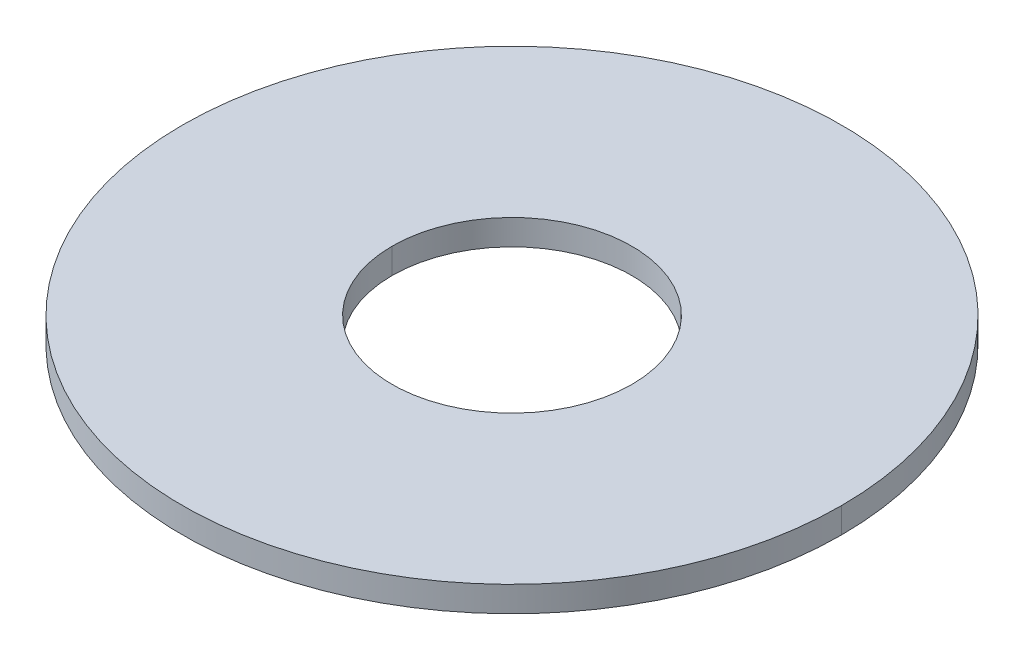
ISO-10303-21;
HEADER;
FILE_DESCRIPTION(('STEP AP214'),'2;1');
FILE_NAME('part.step','',(''),(''),'','','');
FILE_SCHEMA(('AUTOMOTIVE_DESIGN { 1 0 10303 214 1 1 1 1 }'));
ENDSEC;
DATA;
#1=APPLICATION_CONTEXT('core data for automotive mechanical design processes');
#2=APPLICATION_PROTOCOL_DEFINITION('international standard','automotive_design',2000,#1);
#3=PRODUCT_CONTEXT('',#1,'mechanical');
#4=PRODUCT('Part','Part','',(#3));
#5=PRODUCT_RELATED_PRODUCT_CATEGORY('part','',(#4));
#6=PRODUCT_DEFINITION_FORMATION('','',#4);
#7=PRODUCT_DEFINITION_CONTEXT('part definition',#1,'design');
#8=PRODUCT_DEFINITION('design','',#6,#7);
#9=PRODUCT_DEFINITION_SHAPE('','',#8);
#10=(LENGTH_UNIT() NAMED_UNIT(*) SI_UNIT(.MILLI.,.METRE.));
#11=(NAMED_UNIT(*) PLANE_ANGLE_UNIT() SI_UNIT($,.RADIAN.));
#12=(NAMED_UNIT(*) SI_UNIT($,.STERADIAN.) SOLID_ANGLE_UNIT());
#13=UNCERTAINTY_MEASURE_WITH_UNIT(LENGTH_MEASURE(1.E-05),#10,'distance_accuracy_value','');
#14=(GEOMETRIC_REPRESENTATION_CONTEXT(3) GLOBAL_UNCERTAINTY_ASSIGNED_CONTEXT((#13)) GLOBAL_UNIT_ASSIGNED_CONTEXT((#10,
#11,#12)) REPRESENTATION_CONTEXT('',''));
#15=CARTESIAN_POINT('',(0.,0.,0.));
#16=DIRECTION('',(0.,0.,1.));
#17=DIRECTION('',(1.,0.,0.));
#18=AXIS2_PLACEMENT_3D('',#15,#16,#17);
#19=CARTESIAN_POINT('',(0.,0.,0.));
#20=DIRECTION('',(0.,1.,0.));
#21=DIRECTION('',(1.,0.,0.));
#22=AXIS2_PLACEMENT_3D('',#19,#20,#21);
#23=CYLINDRICAL_SURFACE('',#22,4.);
#24=DIRECTION('',(0.,1.,0.));
#25=VECTOR('',#24,1.);
#26=CARTESIAN_POINT('',(4.,0.,0.));
#27=LINE('',#26,#25);
#28=CARTESIAN_POINT('',(4.,0.,0.));
#29=VERTEX_POINT('',#28);
#30=CARTESIAN_POINT('',(4.,0.85,0.));
#31=VERTEX_POINT('',#30);
#32=EDGE_CURVE('E11',#29,#31,#27,.T.);
#33=ORIENTED_EDGE('',*,*,#32,.T.);
#34=CARTESIAN_POINT('',(0.,0.85,0.));
#35=DIRECTION('',(0.,-1.,0.));
#36=DIRECTION('',(-1.,0.,0.));
#37=AXIS2_PLACEMENT_3D('',#34,#35,#36);
#38=CIRCLE('',#37,4.);
#39=CARTESIAN_POINT('',(-4.,0.85,0.));
#40=VERTEX_POINT('',#39);
#41=EDGE_CURVE('E110',#40,#31,#38,.T.);
#42=ORIENTED_EDGE('',*,*,#41,.F.);
#43=DIRECTION('',(0.,1.,0.));
#44=VECTOR('',#43,1.);
#45=CARTESIAN_POINT('',(-4.,0.,0.));
#46=LINE('',#45,#44);
#47=CARTESIAN_POINT('',(-4.,0.,0.));
#48=VERTEX_POINT('',#47);
#49=EDGE_CURVE('E29',#48,#40,#46,.T.);
#50=ORIENTED_EDGE('',*,*,#49,.F.);
#51=CARTESIAN_POINT('',(0.,0.,0.));
#52=DIRECTION('',(0.,-1.,0.));
#53=DIRECTION('',(-1.,0.,0.));
#54=AXIS2_PLACEMENT_3D('',#51,#52,#53);
#55=CIRCLE('',#54,4.);
#56=EDGE_CURVE('E92',#48,#29,#55,.T.);
#57=ORIENTED_EDGE('',*,*,#56,.T.);
#58=EDGE_LOOP('',(#33,#42,#50,#57));
#59=FACE_BOUND('',#58,.T.);
#60=ADVANCED_FACE('F19',(#59),#23,.F.);
#61=CARTESIAN_POINT('',(0.,0.,0.));
#62=DIRECTION('',(0.,1.,0.));
#63=DIRECTION('',(1.,0.,0.));
#64=AXIS2_PLACEMENT_3D('',#61,#62,#63);
#65=CYLINDRICAL_SURFACE('',#64,4.);
#66=ORIENTED_EDGE('',*,*,#49,.T.);
#67=CARTESIAN_POINT('',(0.,0.85,0.));
#68=DIRECTION('',(0.,-1.,0.));
#69=DIRECTION('',(1.,0.,0.));
#70=AXIS2_PLACEMENT_3D('',#67,#68,#69);
#71=CIRCLE('',#70,4.);
#72=EDGE_CURVE('E22',#31,#40,#71,.T.);
#73=ORIENTED_EDGE('',*,*,#72,.F.);
#74=ORIENTED_EDGE('',*,*,#32,.F.);
#75=CARTESIAN_POINT('',(0.,0.,0.));
#76=DIRECTION('',(0.,-1.,0.));
#77=DIRECTION('',(1.,0.,0.));
#78=AXIS2_PLACEMENT_3D('',#75,#76,#77);
#79=CIRCLE('',#78,4.);
#80=EDGE_CURVE('E85',#29,#48,#79,.T.);
#81=ORIENTED_EDGE('',*,*,#80,.T.);
#82=EDGE_LOOP('',(#66,#73,#74,#81));
#83=FACE_BOUND('',#82,.T.);
#84=ADVANCED_FACE('F84',(#83),#65,.F.);
#85=CARTESIAN_POINT('',(0.,0.85,0.));
#86=DIRECTION('',(0.,1.,0.));
#87=DIRECTION('',(1.,0.,0.));
#88=AXIS2_PLACEMENT_3D('',#85,#86,#87);
#89=PLANE('',#88);
#90=ORIENTED_EDGE('',*,*,#41,.T.);
#91=ORIENTED_EDGE('',*,*,#72,.T.);
#92=EDGE_LOOP('',(#90,#91));
#93=FACE_BOUND('',#92,.T.);
#94=CARTESIAN_POINT('',(0.,0.85,0.));
#95=DIRECTION('',(0.,1.,0.));
#96=DIRECTION('',(-1.,0.,0.));
#97=AXIS2_PLACEMENT_3D('',#94,#95,#96);
#98=CIRCLE('',#97,11.);
#99=CARTESIAN_POINT('',(-11.,0.85,0.));
#100=VERTEX_POINT('',#99);
#101=CARTESIAN_POINT('',(11.,0.85,0.));
#102=VERTEX_POINT('',#101);
#103=EDGE_CURVE('E77',#100,#102,#98,.T.);
#104=ORIENTED_EDGE('',*,*,#103,.T.);
#105=CARTESIAN_POINT('',(0.,0.85,0.));
#106=DIRECTION('',(0.,1.,0.));
#107=DIRECTION('',(1.,0.,0.));
#108=AXIS2_PLACEMENT_3D('',#105,#106,#107);
#109=CIRCLE('',#108,11.);
#110=EDGE_CURVE('E121',#102,#100,#109,.T.);
#111=ORIENTED_EDGE('',*,*,#110,.T.);
#112=EDGE_LOOP('',(#104,#111));
#113=FACE_BOUND('',#112,.T.);
#114=ADVANCED_FACE('F129',(#93,#113),#89,.T.);
#115=CARTESIAN_POINT('',(0.,0.,0.));
#116=DIRECTION('',(0.,1.,0.));
#117=DIRECTION('',(1.,0.,0.));
#118=AXIS2_PLACEMENT_3D('',#115,#116,#117);
#119=CYLINDRICAL_SURFACE('',#118,11.);
#120=DIRECTION('',(0.,1.,0.));
#121=VECTOR('',#120,1.);
#122=CARTESIAN_POINT('',(11.,0.,0.));
#123=LINE('',#122,#121);
#124=CARTESIAN_POINT('',(11.,0.,0.));
#125=VERTEX_POINT('',#124);
#126=EDGE_CURVE('E56',#125,#102,#123,.T.);
#127=ORIENTED_EDGE('',*,*,#126,.T.);
#128=ORIENTED_EDGE('',*,*,#103,.F.);
#129=DIRECTION('',(0.,1.,0.));
#130=VECTOR('',#129,1.);
#131=CARTESIAN_POINT('',(-11.,0.,0.));
#132=LINE('',#131,#130);
#133=CARTESIAN_POINT('',(-11.,0.,0.));
#134=VERTEX_POINT('',#133);
#135=EDGE_CURVE('E69',#134,#100,#132,.T.);
#136=ORIENTED_EDGE('',*,*,#135,.F.);
#137=CARTESIAN_POINT('',(0.,0.,0.));
#138=DIRECTION('',(0.,1.,0.));
#139=DIRECTION('',(-1.,0.,0.));
#140=AXIS2_PLACEMENT_3D('',#137,#138,#139);
#141=CIRCLE('',#140,11.);
#142=EDGE_CURVE('E102',#134,#125,#141,.T.);
#143=ORIENTED_EDGE('',*,*,#142,.T.);
#144=EDGE_LOOP('',(#127,#128,#136,#143));
#145=FACE_BOUND('',#144,.T.);
#146=ADVANCED_FACE('F127',(#145),#119,.T.);
#147=CARTESIAN_POINT('',(0.,0.,0.));
#148=DIRECTION('',(0.,1.,0.));
#149=DIRECTION('',(1.,0.,0.));
#150=AXIS2_PLACEMENT_3D('',#147,#148,#149);
#151=CYLINDRICAL_SURFACE('',#150,11.);
#152=ORIENTED_EDGE('',*,*,#135,.T.);
#153=ORIENTED_EDGE('',*,*,#110,.F.);
#154=ORIENTED_EDGE('',*,*,#126,.F.);
#155=CARTESIAN_POINT('',(0.,0.,0.));
#156=DIRECTION('',(0.,1.,0.));
#157=DIRECTION('',(1.,0.,0.));
#158=AXIS2_PLACEMENT_3D('',#155,#156,#157);
#159=CIRCLE('',#158,11.);
#160=EDGE_CURVE('E96',#125,#134,#159,.T.);
#161=ORIENTED_EDGE('',*,*,#160,.T.);
#162=EDGE_LOOP('',(#152,#153,#154,#161));
#163=FACE_BOUND('',#162,.T.);
#164=ADVANCED_FACE('F125',(#163),#151,.T.);
#165=CARTESIAN_POINT('',(0.,0.,0.));
#166=DIRECTION('',(0.,1.,0.));
#167=DIRECTION('',(1.,0.,0.));
#168=AXIS2_PLACEMENT_3D('',#165,#166,#167);
#169=PLANE('',#168);
#170=ORIENTED_EDGE('',*,*,#56,.F.);
#171=ORIENTED_EDGE('',*,*,#80,.F.);
#172=EDGE_LOOP('',(#170,#171));
#173=FACE_BOUND('',#172,.T.);
#174=ORIENTED_EDGE('',*,*,#142,.F.);
#175=ORIENTED_EDGE('',*,*,#160,.F.);
#176=EDGE_LOOP('',(#174,#175));
#177=FACE_BOUND('',#176,.T.);
#178=ADVANCED_FACE('F90',(#173,#177),#169,.F.);
#179=CLOSED_SHELL('',(#60,#84,#114,#146,#164,#178));
#180=MANIFOLD_SOLID_BREP('B1',#179);
#181=ADVANCED_BREP_SHAPE_REPRESENTATION('',(#18,#180),#14);
#182=SHAPE_DEFINITION_REPRESENTATION(#9,#181);
ENDSEC;
END-ISO-10303-21;
